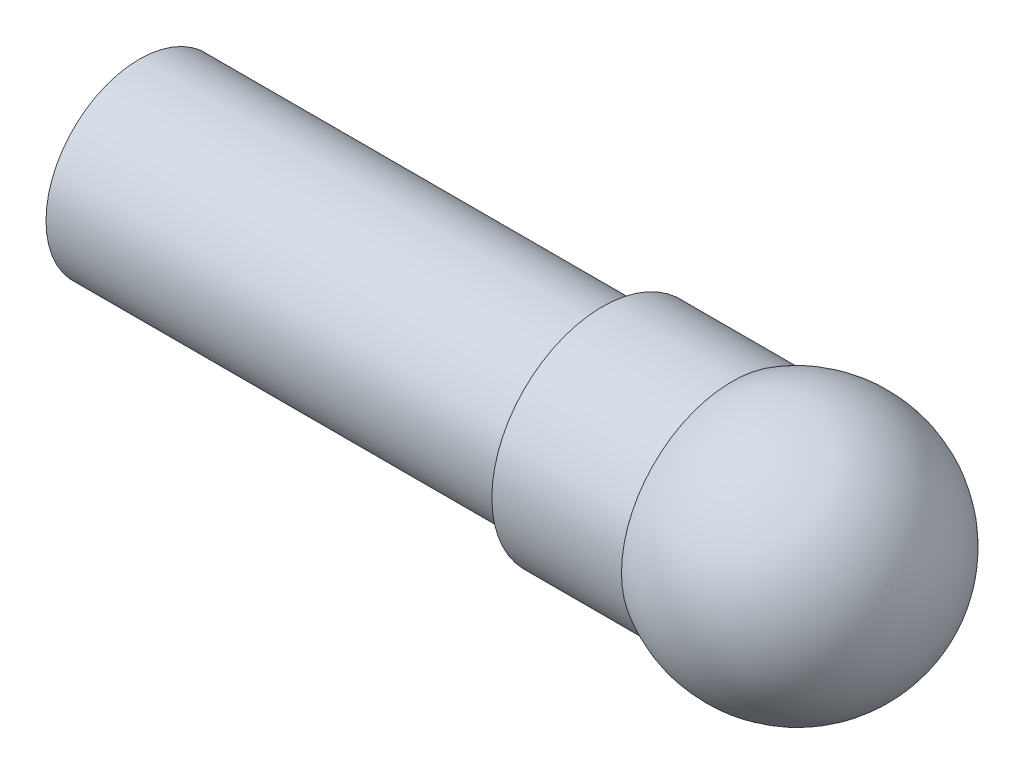
ISO-10303-21;
HEADER;
FILE_DESCRIPTION(('STEP AP214'),'2;1');
FILE_NAME('part.step','',(''),(''),'','','');
FILE_SCHEMA(('AUTOMOTIVE_DESIGN { 1 0 10303 214 1 1 1 1 }'));
ENDSEC;
DATA;
#1=APPLICATION_CONTEXT('core data for automotive mechanical design processes');
#2=APPLICATION_PROTOCOL_DEFINITION('international standard','automotive_design',2000,#1);
#3=PRODUCT_CONTEXT('',#1,'mechanical');
#4=PRODUCT('Part','Part','',(#3));
#5=PRODUCT_RELATED_PRODUCT_CATEGORY('part','',(#4));
#6=PRODUCT_DEFINITION_FORMATION('','',#4);
#7=PRODUCT_DEFINITION_CONTEXT('part definition',#1,'design');
#8=PRODUCT_DEFINITION('design','',#6,#7);
#9=PRODUCT_DEFINITION_SHAPE('','',#8);
#10=(LENGTH_UNIT() NAMED_UNIT(*) SI_UNIT(.MILLI.,.METRE.));
#11=(NAMED_UNIT(*) PLANE_ANGLE_UNIT() SI_UNIT($,.RADIAN.));
#12=(NAMED_UNIT(*) SI_UNIT($,.STERADIAN.) SOLID_ANGLE_UNIT());
#13=UNCERTAINTY_MEASURE_WITH_UNIT(LENGTH_MEASURE(1.E-05),#10,'distance_accuracy_value','');
#14=(GEOMETRIC_REPRESENTATION_CONTEXT(3) GLOBAL_UNCERTAINTY_ASSIGNED_CONTEXT((#13)) GLOBAL_UNIT_ASSIGNED_CONTEXT((#10,
#11,#12)) REPRESENTATION_CONTEXT('',''));
#15=CARTESIAN_POINT('',(0.,0.,0.));
#16=DIRECTION('',(0.,0.,1.));
#17=DIRECTION('',(1.,0.,0.));
#18=AXIS2_PLACEMENT_3D('',#15,#16,#17);
#19=CARTESIAN_POINT('',(-64.,0.,0.));
#20=DIRECTION('',(1.,0.,0.));
#21=DIRECTION('',(0.,0.,-1.));
#22=AXIS2_PLACEMENT_3D('',#19,#20,#21);
#23=PLANE('',#22);
#24=CARTESIAN_POINT('',(-64.,0.,12.0799918612328));
#25=DIRECTION('',(-1.,0.,0.));
#26=DIRECTION('',(0.,0.,1.));
#27=AXIS2_PLACEMENT_3D('',#24,#25,#26);
#28=CIRCLE('',#27,8.07999186123277);
#29=CARTESIAN_POINT('',(-64.,0.,20.1599837224655));
#30=VERTEX_POINT('',#29);
#31=EDGE_CURVE('E75',#30,#30,#28,.T.);
#32=ORIENTED_EDGE('',*,*,#31,.F.);
#33=EDGE_LOOP('',(#32));
#34=FACE_BOUND('',#33,.T.);
#35=CARTESIAN_POINT('',(-64.,0.,12.0799918612328));
#36=DIRECTION('',(-1.,0.,0.));
#37=DIRECTION('',(0.,0.,1.));
#38=AXIS2_PLACEMENT_3D('',#35,#36,#37);
#39=CIRCLE('',#38,10.0799918612328);
#40=CARTESIAN_POINT('',(-64.,0.,22.1599837224655));
#41=VERTEX_POINT('',#40);
#42=EDGE_CURVE('E11',#41,#41,#39,.T.);
#43=ORIENTED_EDGE('',*,*,#42,.T.);
#44=EDGE_LOOP('',(#43));
#45=FACE_BOUND('',#44,.T.);
#46=ADVANCED_FACE('F39',(#34,#45),#23,.F.);
#47=CARTESIAN_POINT('',(-74.4188554984104,0.,12.0799918612328));
#48=DIRECTION('',(-1.,0.,0.));
#49=DIRECTION('',(0.,0.,1.));
#50=AXIS2_PLACEMENT_3D('',#47,#48,#49);
#51=CYLINDRICAL_SURFACE('',#50,10.0799918612328);
#52=ORIENTED_EDGE('',*,*,#42,.F.);
#53=EDGE_LOOP('',(#52));
#54=FACE_BOUND('',#53,.T.);
#55=CARTESIAN_POINT('',(-14.,0.,12.0799918612328));
#56=DIRECTION('',(-1.,0.,0.));
#57=DIRECTION('',(0.,0.,1.));
#58=AXIS2_PLACEMENT_3D('',#55,#56,#57);
#59=CIRCLE('',#58,10.0799918612328);
#60=CARTESIAN_POINT('',(-14.,0.,22.1599837224655));
#61=VERTEX_POINT('',#60);
#62=EDGE_CURVE('E45',#61,#61,#59,.T.);
#63=ORIENTED_EDGE('',*,*,#62,.T.);
#64=EDGE_LOOP('',(#63));
#65=FACE_BOUND('',#64,.T.);
#66=ADVANCED_FACE('F66',(#54,#65),#51,.T.);
#67=CARTESIAN_POINT('',(-14.,0.,0.));
#68=DIRECTION('',(-1.,0.,0.));
#69=DIRECTION('',(0.,0.,1.));
#70=AXIS2_PLACEMENT_3D('',#67,#68,#69);
#71=PLANE('',#70);
#72=CARTESIAN_POINT('',(-14.,0.,12.0799918612328));
#73=DIRECTION('',(-1.,0.,0.));
#74=DIRECTION('',(0.,0.,1.));
#75=AXIS2_PLACEMENT_3D('',#72,#73,#74);
#76=CIRCLE('',#75,11.9200081387672);
#77=CARTESIAN_POINT('',(-14.,0.,24.));
#78=VERTEX_POINT('',#77);
#79=EDGE_CURVE('E81',#78,#78,#76,.T.);
#80=ORIENTED_EDGE('',*,*,#79,.T.);
#81=EDGE_LOOP('',(#80));
#82=FACE_BOUND('',#81,.T.);
#83=ORIENTED_EDGE('',*,*,#62,.F.);
#84=EDGE_LOOP('',(#83));
#85=FACE_BOUND('',#84,.T.);
#86=ADVANCED_FACE('F61',(#82,#85),#71,.T.);
#87=CARTESIAN_POINT('',(-74.4188554984104,0.,12.0799918612328));
#88=DIRECTION('',(-1.,0.,0.));
#89=DIRECTION('',(0.,0.,1.));
#90=AXIS2_PLACEMENT_3D('',#87,#88,#89);
#91=CYLINDRICAL_SURFACE('',#90,11.9200081387672);
#92=ORIENTED_EDGE('',*,*,#79,.F.);
#93=EDGE_LOOP('',(#92));
#94=FACE_BOUND('',#93,.T.);
#95=CARTESIAN_POINT('',(0.,0.,12.0799918612328));
#96=DIRECTION('',(-1.,0.,0.));
#97=DIRECTION('',(0.,0.,1.));
#98=AXIS2_PLACEMENT_3D('',#95,#96,#97);
#99=CIRCLE('',#98,11.9200081387672);
#100=CARTESIAN_POINT('',(0.,0.,24.));
#101=VERTEX_POINT('',#100);
#102=EDGE_CURVE('E83',#101,#101,#99,.T.);
#103=ORIENTED_EDGE('',*,*,#102,.T.);
#104=EDGE_LOOP('',(#103));
#105=FACE_BOUND('',#104,.T.);
#106=ADVANCED_FACE('F51',(#94,#105),#91,.T.);
#107=CARTESIAN_POINT('',(7.01589309071244,0.,12.));
#108=DIRECTION('',(0.,-1.,0.));
#109=DIRECTION('',(0.,0.,1.));
#110=AXIS2_PLACEMENT_3D('',#107,#108,#109);
#111=CIRCLE('',#110,13.9004588363229);
#112=TRIMMED_CURVE('',#111,(PARAMETER_VALUE(-1.56504167483136)),
(PARAMETER_VALUE(1.56504167483136)),.T.,.PARAMETER.);
#113=CARTESIAN_POINT('',(7.01589309071244,0.,12.0799918612328));
#114=DIRECTION('',(-1.,0.,0.));
#115=AXIS1_PLACEMENT('',#113,#114);
#116=SURFACE_OF_REVOLUTION('',#112,#115);
#117=ORIENTED_EDGE('',*,*,#102,.F.);
#118=EDGE_LOOP('',(#117));
#119=FACE_BOUND('',#118,.T.);
#120=CARTESIAN_POINT('',(20.9161217637395,0.,12.0799918612328));
#121=VERTEX_POINT('',#120);
#122=VERTEX_LOOP('',#121);
#123=FACE_BOUND('',#122,.T.);
#124=ADVANCED_FACE('F48',(#119,#123),#116,.T.);
#125=CARTESIAN_POINT('',(6.75225100524574,0.,12.0799918612328));
#126=DIRECTION('',(-1.,0.,0.));
#127=DIRECTION('',(0.,0.,-1.));
#128=AXIS2_PLACEMENT_3D('',#125,#126,#127);
#129=SPHERICAL_SURFACE('',#128,12.1325648384981);
#130=CARTESIAN_POINT('',(0.,0.,12.0799918612328));
#131=DIRECTION('',(-1.,0.,0.));
#132=DIRECTION('',(0.,0.,1.));
#133=AXIS2_PLACEMENT_3D('',#130,#131,#132);
#134=CIRCLE('',#133,10.0799918612328);
#135=CARTESIAN_POINT('',(0.,0.,22.1599837224655));
#136=VERTEX_POINT('',#135);
#137=EDGE_CURVE('E88',#136,#136,#134,.T.);
#138=ORIENTED_EDGE('',*,*,#137,.T.);
#139=EDGE_LOOP('',(#138));
#140=FACE_BOUND('',#139,.T.);
#141=ADVANCED_FACE('F50',(#140),#129,.F.);
#142=CARTESIAN_POINT('',(0.,0.,0.));
#143=DIRECTION('',(-1.,0.,0.));
#144=DIRECTION('',(0.,0.,1.));
#145=AXIS2_PLACEMENT_3D('',#142,#143,#144);
#146=PLANE('',#145);
#147=ORIENTED_EDGE('',*,*,#137,.F.);
#148=EDGE_LOOP('',(#147));
#149=FACE_BOUND('',#148,.T.);
#150=CARTESIAN_POINT('',(0.,0.,12.0799918612328));
#151=DIRECTION('',(-1.,0.,0.));
#152=DIRECTION('',(0.,0.,1.));
#153=AXIS2_PLACEMENT_3D('',#150,#151,#152);
#154=CIRCLE('',#153,8.07999186123276);
#155=CARTESIAN_POINT('',(0.,0.,20.1599837224655));
#156=VERTEX_POINT('',#155);
#157=EDGE_CURVE('E91',#156,#156,#154,.T.);
#158=ORIENTED_EDGE('',*,*,#157,.T.);
#159=EDGE_LOOP('',(#158));
#160=FACE_BOUND('',#159,.T.);
#161=ADVANCED_FACE('F58',(#149,#160),#146,.F.);
#162=CARTESIAN_POINT('',(-74.4188554984104,0.,12.0799918612328));
#163=DIRECTION('',(-1.,0.,0.));
#164=DIRECTION('',(0.,0.,1.));
#165=AXIS2_PLACEMENT_3D('',#162,#163,#164);
#166=CYLINDRICAL_SURFACE('',#165,8.07999186123276);
#167=ORIENTED_EDGE('',*,*,#157,.F.);
#168=EDGE_LOOP('',(#167));
#169=FACE_BOUND('',#168,.T.);
#170=ORIENTED_EDGE('',*,*,#31,.T.);
#171=EDGE_LOOP('',(#170));
#172=FACE_BOUND('',#171,.T.);
#173=ADVANCED_FACE('F95',(#169,#172),#166,.F.);
#174=CLOSED_SHELL('',(#46,#66,#86,#106,#124,#141,#161,#173));
#175=MANIFOLD_SOLID_BREP('B2',#174);
#176=ADVANCED_BREP_SHAPE_REPRESENTATION('',(#18,#175),#14);
#177=SHAPE_DEFINITION_REPRESENTATION(#9,#176);
ENDSEC;
END-ISO-10303-21;
